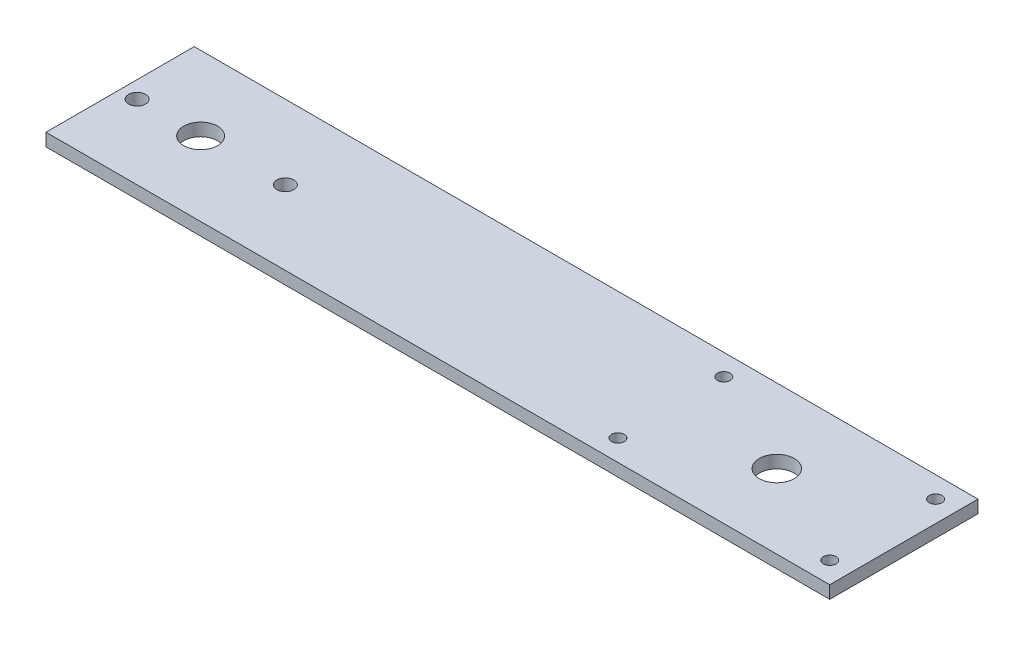
ISO-10303-21;
HEADER;
FILE_DESCRIPTION(('STEP AP214'),'2;1');
FILE_NAME('part.step','',(''),(''),'','','');
FILE_SCHEMA(('AUTOMOTIVE_DESIGN { 1 0 10303 214 1 1 1 1 }'));
ENDSEC;
DATA;
#1=APPLICATION_CONTEXT('core data for automotive mechanical design processes');
#2=APPLICATION_PROTOCOL_DEFINITION('international standard','automotive_design',2000,#1);
#3=PRODUCT_CONTEXT('',#1,'mechanical');
#4=PRODUCT('Part','Part','',(#3));
#5=PRODUCT_RELATED_PRODUCT_CATEGORY('part','',(#4));
#6=PRODUCT_DEFINITION_FORMATION('','',#4);
#7=PRODUCT_DEFINITION_CONTEXT('part definition',#1,'design');
#8=PRODUCT_DEFINITION('design','',#6,#7);
#9=PRODUCT_DEFINITION_SHAPE('','',#8);
#10=(LENGTH_UNIT() NAMED_UNIT(*) SI_UNIT(.MILLI.,.METRE.));
#11=(NAMED_UNIT(*) PLANE_ANGLE_UNIT() SI_UNIT($,.RADIAN.));
#12=(NAMED_UNIT(*) SI_UNIT($,.STERADIAN.) SOLID_ANGLE_UNIT());
#13=UNCERTAINTY_MEASURE_WITH_UNIT(LENGTH_MEASURE(1.E-05),#10,'distance_accuracy_value','');
#14=(GEOMETRIC_REPRESENTATION_CONTEXT(3) GLOBAL_UNCERTAINTY_ASSIGNED_CONTEXT((#13)) GLOBAL_UNIT_ASSIGNED_CONTEXT((#10,
#11,#12)) REPRESENTATION_CONTEXT('',''));
#15=CARTESIAN_POINT('',(0.,0.,0.));
#16=DIRECTION('',(0.,0.,1.));
#17=DIRECTION('',(1.,0.,0.));
#18=AXIS2_PLACEMENT_3D('',#15,#16,#17);
#19=CARTESIAN_POINT('',(92.5,3.,0.));
#20=DIRECTION('',(1.,0.,0.));
#21=DIRECTION('',(0.,0.,-1.));
#22=AXIS2_PLACEMENT_3D('',#19,#20,#21);
#23=PLANE('',#22);
#24=DIRECTION('',(0.,0.,1.));
#25=VECTOR('',#24,1.);
#26=CARTESIAN_POINT('',(92.5,0.,0.));
#27=LINE('',#26,#25);
#28=CARTESIAN_POINT('',(92.5,0.,-17.5));
#29=VERTEX_POINT('',#28);
#30=CARTESIAN_POINT('',(92.5,0.,17.5));
#31=VERTEX_POINT('',#30);
#32=EDGE_CURVE('E117',#29,#31,#27,.T.);
#33=ORIENTED_EDGE('',*,*,#32,.F.);
#34=DIRECTION('',(0.,-1.,0.));
#35=VECTOR('',#34,1.);
#36=CARTESIAN_POINT('',(92.5,3.,-17.5));
#37=LINE('',#36,#35);
#38=CARTESIAN_POINT('',(92.5,3.,-17.5));
#39=VERTEX_POINT('',#38);
#40=EDGE_CURVE('E11',#39,#29,#37,.T.);
#41=ORIENTED_EDGE('',*,*,#40,.F.);
#42=DIRECTION('',(0.,0.,1.));
#43=VECTOR('',#42,1.);
#44=CARTESIAN_POINT('',(92.5,3.,0.));
#45=LINE('',#44,#43);
#46=CARTESIAN_POINT('',(92.5,3.,17.5));
#47=VERTEX_POINT('',#46);
#48=EDGE_CURVE('E97',#39,#47,#45,.T.);
#49=ORIENTED_EDGE('',*,*,#48,.T.);
#50=DIRECTION('',(0.,-1.,0.));
#51=VECTOR('',#50,1.);
#52=CARTESIAN_POINT('',(92.5,3.,17.5));
#53=LINE('',#52,#51);
#54=EDGE_CURVE('E76',#47,#31,#53,.T.);
#55=ORIENTED_EDGE('',*,*,#54,.T.);
#56=EDGE_LOOP('',(#33,#41,#49,#55));
#57=FACE_BOUND('',#56,.T.);
#58=ADVANCED_FACE('F36',(#57),#23,.T.);
#59=CARTESIAN_POINT('',(0.,3.,-17.5));
#60=DIRECTION('',(0.,0.,-1.));
#61=DIRECTION('',(-1.,0.,0.));
#62=AXIS2_PLACEMENT_3D('',#59,#60,#61);
#63=PLANE('',#62);
#64=DIRECTION('',(1.,0.,0.));
#65=VECTOR('',#64,1.);
#66=CARTESIAN_POINT('',(0.,0.,-17.5));
#67=LINE('',#66,#65);
#68=CARTESIAN_POINT('',(-92.5,0.,-17.5));
#69=VERTEX_POINT('',#68);
#70=EDGE_CURVE('E88',#69,#29,#67,.T.);
#71=ORIENTED_EDGE('',*,*,#70,.F.);
#72=DIRECTION('',(0.,-1.,0.));
#73=VECTOR('',#72,1.);
#74=CARTESIAN_POINT('',(-92.5,3.,-17.5));
#75=LINE('',#74,#73);
#76=CARTESIAN_POINT('',(-92.5,3.,-17.5));
#77=VERTEX_POINT('',#76);
#78=EDGE_CURVE('E45',#77,#69,#75,.T.);
#79=ORIENTED_EDGE('',*,*,#78,.F.);
#80=DIRECTION('',(1.,0.,0.));
#81=VECTOR('',#80,1.);
#82=CARTESIAN_POINT('',(0.,3.,-17.5));
#83=LINE('',#82,#81);
#84=EDGE_CURVE('E86',#77,#39,#83,.T.);
#85=ORIENTED_EDGE('',*,*,#84,.T.);
#86=ORIENTED_EDGE('',*,*,#40,.T.);
#87=EDGE_LOOP('',(#71,#79,#85,#86));
#88=FACE_BOUND('',#87,.T.);
#89=ADVANCED_FACE('F84',(#88),#63,.T.);
#90=CARTESIAN_POINT('',(-92.5,3.,0.));
#91=DIRECTION('',(1.,0.,0.));
#92=DIRECTION('',(0.,0.,-1.));
#93=AXIS2_PLACEMENT_3D('',#90,#91,#92);
#94=PLANE('',#93);
#95=DIRECTION('',(0.,0.,1.));
#96=VECTOR('',#95,1.);
#97=CARTESIAN_POINT('',(-92.5,0.,0.));
#98=LINE('',#97,#96);
#99=CARTESIAN_POINT('',(-92.5,0.,17.5));
#100=VERTEX_POINT('',#99);
#101=EDGE_CURVE('E120',#69,#100,#98,.T.);
#102=ORIENTED_EDGE('',*,*,#101,.T.);
#103=DIRECTION('',(0.,-1.,0.));
#104=VECTOR('',#103,1.);
#105=CARTESIAN_POINT('',(-92.5,3.,17.5));
#106=LINE('',#105,#104);
#107=CARTESIAN_POINT('',(-92.5,3.,17.5));
#108=VERTEX_POINT('',#107);
#109=EDGE_CURVE('E91',#108,#100,#106,.T.);
#110=ORIENTED_EDGE('',*,*,#109,.F.);
#111=DIRECTION('',(0.,0.,1.));
#112=VECTOR('',#111,1.);
#113=CARTESIAN_POINT('',(-92.5,3.,0.));
#114=LINE('',#113,#112);
#115=EDGE_CURVE('E93',#77,#108,#114,.T.);
#116=ORIENTED_EDGE('',*,*,#115,.F.);
#117=ORIENTED_EDGE('',*,*,#78,.T.);
#118=EDGE_LOOP('',(#102,#110,#116,#117));
#119=FACE_BOUND('',#118,.T.);
#120=ADVANCED_FACE('F94',(#119),#94,.F.);
#121=CARTESIAN_POINT('',(62.5,3.,0.));
#122=DIRECTION('',(0.,-1.,0.));
#123=DIRECTION('',(0.,0.,-1.));
#124=AXIS2_PLACEMENT_3D('',#121,#122,#123);
#125=CYLINDRICAL_SURFACE('',#124,4.125);
#126=CARTESIAN_POINT('',(62.5,3.,0.));
#127=DIRECTION('',(0.,1.,0.));
#128=DIRECTION('',(0.,0.,1.));
#129=AXIS2_PLACEMENT_3D('',#126,#127,#128);
#130=CIRCLE('',#129,4.125);
#131=CARTESIAN_POINT('',(62.5,3.,4.12500000000004));
#132=VERTEX_POINT('',#131);
#133=EDGE_CURVE('E99',#132,#132,#130,.T.);
#134=ORIENTED_EDGE('',*,*,#133,.T.);
#135=EDGE_LOOP('',(#134));
#136=FACE_BOUND('',#135,.T.);
#137=CARTESIAN_POINT('',(62.5,0.,0.));
#138=DIRECTION('',(0.,1.,0.));
#139=DIRECTION('',(0.,0.,1.));
#140=AXIS2_PLACEMENT_3D('',#137,#138,#139);
#141=CIRCLE('',#140,4.125);
#142=CARTESIAN_POINT('',(62.5,0.,4.12500000000004));
#143=VERTEX_POINT('',#142);
#144=EDGE_CURVE('E114',#143,#143,#141,.T.);
#145=ORIENTED_EDGE('',*,*,#144,.F.);
#146=EDGE_LOOP('',(#145));
#147=FACE_BOUND('',#146,.T.);
#148=ADVANCED_FACE('F136',(#136,#147),#125,.F.);
#149=CARTESIAN_POINT('',(-88.4999999999916,3.,3.62442888202086E-11));
#150=DIRECTION('',(0.,-1.,0.));
#151=DIRECTION('',(0.,0.,-1.));
#152=AXIS2_PLACEMENT_3D('',#149,#150,#151);
#153=CYLINDRICAL_SURFACE('',#152,2.00000000000315);
#154=CARTESIAN_POINT('',(-88.4999999999916,3.,3.62442888202086E-11));
#155=DIRECTION('',(0.,1.,0.));
#156=DIRECTION('',(0.,0.,1.));
#157=AXIS2_PLACEMENT_3D('',#154,#155,#156);
#158=CIRCLE('',#157,2.00000000000315);
#159=CARTESIAN_POINT('',(-88.4999999999916,3.,2.0000000000394));
#160=VERTEX_POINT('',#159);
#161=EDGE_CURVE('E279',#160,#160,#158,.T.);
#162=ORIENTED_EDGE('',*,*,#161,.T.);
#163=EDGE_LOOP('',(#162));
#164=FACE_BOUND('',#163,.T.);
#165=CARTESIAN_POINT('',(-88.4999999999916,0.,3.62442888202086E-11));
#166=DIRECTION('',(0.,1.,0.));
#167=DIRECTION('',(0.,0.,1.));
#168=AXIS2_PLACEMENT_3D('',#165,#166,#167);
#169=CIRCLE('',#168,2.00000000000315);
#170=CARTESIAN_POINT('',(-88.4999999999916,0.,2.0000000000394));
#171=VERTEX_POINT('',#170);
#172=EDGE_CURVE('E111',#171,#171,#169,.T.);
#173=ORIENTED_EDGE('',*,*,#172,.F.);
#174=EDGE_LOOP('',(#173));
#175=FACE_BOUND('',#174,.T.);
#176=ADVANCED_FACE('F139',(#164,#175),#153,.F.);
#177=CARTESIAN_POINT('',(-53.4999999999916,3.,3.2832243868075E-11));
#178=DIRECTION('',(0.,-1.,0.));
#179=DIRECTION('',(0.,0.,-1.));
#180=AXIS2_PLACEMENT_3D('',#177,#178,#179);
#181=CYLINDRICAL_SURFACE('',#180,2.00000000000207);
#182=CARTESIAN_POINT('',(-53.4999999999916,3.,3.2832243868075E-11));
#183=DIRECTION('',(0.,1.,0.));
#184=DIRECTION('',(0.,0.,1.));
#185=AXIS2_PLACEMENT_3D('',#182,#183,#184);
#186=CIRCLE('',#185,2.00000000000207);
#187=CARTESIAN_POINT('',(-53.4999999999916,3.,2.0000000000349));
#188=VERTEX_POINT('',#187);
#189=EDGE_CURVE('E153',#188,#188,#186,.T.);
#190=ORIENTED_EDGE('',*,*,#189,.T.);
#191=EDGE_LOOP('',(#190));
#192=FACE_BOUND('',#191,.T.);
#193=CARTESIAN_POINT('',(-53.4999999999916,0.,3.2832243868075E-11));
#194=DIRECTION('',(0.,1.,0.));
#195=DIRECTION('',(0.,0.,1.));
#196=AXIS2_PLACEMENT_3D('',#193,#194,#195);
#197=CIRCLE('',#196,2.00000000000207);
#198=CARTESIAN_POINT('',(-53.4999999999916,0.,2.0000000000349));
#199=VERTEX_POINT('',#198);
#200=EDGE_CURVE('E107',#199,#199,#197,.T.);
#201=ORIENTED_EDGE('',*,*,#200,.F.);
#202=EDGE_LOOP('',(#201));
#203=FACE_BOUND('',#202,.T.);
#204=ADVANCED_FACE('F142',(#192,#203),#181,.F.);
#205=CARTESIAN_POINT('',(-73.4999999999917,3.,3.57240279025284E-11));
#206=DIRECTION('',(0.,-1.,0.));
#207=DIRECTION('',(0.,0.,-1.));
#208=AXIS2_PLACEMENT_3D('',#205,#206,#207);
#209=CYLINDRICAL_SURFACE('',#208,4.00000000000001);
#210=CARTESIAN_POINT('',(-73.4999999999917,3.,3.57240279025284E-11));
#211=DIRECTION('',(0.,1.,0.));
#212=DIRECTION('',(0.,0.,1.));
#213=AXIS2_PLACEMENT_3D('',#210,#211,#212);
#214=CIRCLE('',#213,4.00000000000001);
#215=CARTESIAN_POINT('',(-73.4999999999917,3.,4.00000000003573));
#216=VERTEX_POINT('',#215);
#217=EDGE_CURVE('E123',#216,#216,#214,.T.);
#218=ORIENTED_EDGE('',*,*,#217,.T.);
#219=EDGE_LOOP('',(#218));
#220=FACE_BOUND('',#219,.T.);
#221=CARTESIAN_POINT('',(-73.4999999999917,0.,3.57240279025284E-11));
#222=DIRECTION('',(0.,1.,0.));
#223=DIRECTION('',(0.,0.,1.));
#224=AXIS2_PLACEMENT_3D('',#221,#222,#223);
#225=CIRCLE('',#224,4.00000000000001);
#226=CARTESIAN_POINT('',(-73.4999999999917,0.,4.00000000003573));
#227=VERTEX_POINT('',#226);
#228=EDGE_CURVE('E104',#227,#227,#225,.T.);
#229=ORIENTED_EDGE('',*,*,#228,.F.);
#230=EDGE_LOOP('',(#229));
#231=FACE_BOUND('',#230,.T.);
#232=ADVANCED_FACE('F38',(#220,#231),#209,.F.);
#233=CARTESIAN_POINT('',(0.,3.,17.5));
#234=DIRECTION('',(0.,0.,-1.));
#235=DIRECTION('',(-1.,0.,0.));
#236=AXIS2_PLACEMENT_3D('',#233,#234,#235);
#237=PLANE('',#236);
#238=DIRECTION('',(1.,0.,0.));
#239=VECTOR('',#238,1.);
#240=CARTESIAN_POINT('',(0.,0.,17.5));
#241=LINE('',#240,#239);
#242=EDGE_CURVE('E69',#100,#31,#241,.T.);
#243=ORIENTED_EDGE('',*,*,#242,.T.);
#244=ORIENTED_EDGE('',*,*,#54,.F.);
#245=DIRECTION('',(1.,0.,0.));
#246=VECTOR('',#245,1.);
#247=CARTESIAN_POINT('',(0.,3.,17.5));
#248=LINE('',#247,#246);
#249=EDGE_CURVE('E53',#108,#47,#248,.T.);
#250=ORIENTED_EDGE('',*,*,#249,.F.);
#251=ORIENTED_EDGE('',*,*,#109,.T.);
#252=EDGE_LOOP('',(#243,#244,#250,#251));
#253=FACE_BOUND('',#252,.T.);
#254=ADVANCED_FACE('F126',(#253),#237,.F.);
#255=CARTESIAN_POINT('',(0.,3.,0.));
#256=DIRECTION('',(0.,1.,0.));
#257=DIRECTION('',(0.,0.,1.));
#258=AXIS2_PLACEMENT_3D('',#255,#256,#257);
#259=PLANE('',#258);
#260=CARTESIAN_POINT('',(37.5,3.,-12.5));
#261=DIRECTION('',(0.,1.,0.));
#262=DIRECTION('',(0.,0.,-1.));
#263=AXIS2_PLACEMENT_3D('',#260,#261,#262);
#264=CIRCLE('',#263,1.5);
#265=CARTESIAN_POINT('',(37.5,3.,-14.));
#266=VERTEX_POINT('',#265);
#267=EDGE_CURVE('E264',#266,#266,#264,.T.);
#268=ORIENTED_EDGE('',*,*,#267,.F.);
#269=EDGE_LOOP('',(#268));
#270=FACE_BOUND('',#269,.T.);
#271=CARTESIAN_POINT('',(37.5,3.,12.5));
#272=DIRECTION('',(0.,1.,0.));
#273=DIRECTION('',(0.,0.,1.));
#274=AXIS2_PLACEMENT_3D('',#271,#272,#273);
#275=CIRCLE('',#274,1.5);
#276=CARTESIAN_POINT('',(37.5,3.,14.));
#277=VERTEX_POINT('',#276);
#278=EDGE_CURVE('E266',#277,#277,#275,.T.);
#279=ORIENTED_EDGE('',*,*,#278,.F.);
#280=EDGE_LOOP('',(#279));
#281=FACE_BOUND('',#280,.T.);
#282=CARTESIAN_POINT('',(87.5,3.,12.5));
#283=DIRECTION('',(0.,1.,0.));
#284=DIRECTION('',(0.,0.,-1.));
#285=AXIS2_PLACEMENT_3D('',#282,#283,#284);
#286=CIRCLE('',#285,1.5);
#287=CARTESIAN_POINT('',(87.5,3.,11.));
#288=VERTEX_POINT('',#287);
#289=EDGE_CURVE('E295',#288,#288,#286,.T.);
#290=ORIENTED_EDGE('',*,*,#289,.F.);
#291=EDGE_LOOP('',(#290));
#292=FACE_BOUND('',#291,.T.);
#293=CARTESIAN_POINT('',(87.5,3.,-12.5));
#294=DIRECTION('',(0.,1.,0.));
#295=DIRECTION('',(0.,0.,1.));
#296=AXIS2_PLACEMENT_3D('',#293,#294,#295);
#297=CIRCLE('',#296,1.5);
#298=CARTESIAN_POINT('',(87.5,3.,-11.));
#299=VERTEX_POINT('',#298);
#300=EDGE_CURVE('E272',#299,#299,#297,.T.);
#301=ORIENTED_EDGE('',*,*,#300,.F.);
#302=EDGE_LOOP('',(#301));
#303=FACE_BOUND('',#302,.T.);
#304=ORIENTED_EDGE('',*,*,#217,.F.);
#305=EDGE_LOOP('',(#304));
#306=FACE_BOUND('',#305,.T.);
#307=ORIENTED_EDGE('',*,*,#189,.F.);
#308=EDGE_LOOP('',(#307));
#309=FACE_BOUND('',#308,.T.);
#310=ORIENTED_EDGE('',*,*,#161,.F.);
#311=EDGE_LOOP('',(#310));
#312=FACE_BOUND('',#311,.T.);
#313=ORIENTED_EDGE('',*,*,#133,.F.);
#314=EDGE_LOOP('',(#313));
#315=FACE_BOUND('',#314,.T.);
#316=ORIENTED_EDGE('',*,*,#48,.F.);
#317=ORIENTED_EDGE('',*,*,#84,.F.);
#318=ORIENTED_EDGE('',*,*,#115,.T.);
#319=ORIENTED_EDGE('',*,*,#249,.T.);
#320=EDGE_LOOP('',(#316,#317,#318,#319));
#321=FACE_BOUND('',#320,.T.);
#322=ADVANCED_FACE('F96',(#270,#281,#292,#303,#306,#309,#312,#315,#321),#259,.T.);
#323=CARTESIAN_POINT('',(0.,0.,0.));
#324=DIRECTION('',(0.,1.,0.));
#325=DIRECTION('',(0.,0.,1.));
#326=AXIS2_PLACEMENT_3D('',#323,#324,#325);
#327=PLANE('',#326);
#328=CARTESIAN_POINT('',(37.5,0.,-12.5));
#329=DIRECTION('',(0.,1.,0.));
#330=DIRECTION('',(0.,0.,-1.));
#331=AXIS2_PLACEMENT_3D('',#328,#329,#330);
#332=CIRCLE('',#331,1.5);
#333=CARTESIAN_POINT('',(37.5,0.,-14.));
#334=VERTEX_POINT('',#333);
#335=EDGE_CURVE('E261',#334,#334,#332,.T.);
#336=ORIENTED_EDGE('',*,*,#335,.T.);
#337=EDGE_LOOP('',(#336));
#338=FACE_BOUND('',#337,.T.);
#339=CARTESIAN_POINT('',(37.5,0.,12.5));
#340=DIRECTION('',(0.,1.,0.));
#341=DIRECTION('',(0.,0.,1.));
#342=AXIS2_PLACEMENT_3D('',#339,#340,#341);
#343=CIRCLE('',#342,1.5);
#344=CARTESIAN_POINT('',(37.5,0.,14.));
#345=VERTEX_POINT('',#344);
#346=EDGE_CURVE('E300',#345,#345,#343,.T.);
#347=ORIENTED_EDGE('',*,*,#346,.T.);
#348=EDGE_LOOP('',(#347));
#349=FACE_BOUND('',#348,.T.);
#350=CARTESIAN_POINT('',(87.5,0.,12.5));
#351=DIRECTION('',(0.,1.,0.));
#352=DIRECTION('',(0.,0.,-1.));
#353=AXIS2_PLACEMENT_3D('',#350,#351,#352);
#354=CIRCLE('',#353,1.5);
#355=CARTESIAN_POINT('',(87.5,0.,11.));
#356=VERTEX_POINT('',#355);
#357=EDGE_CURVE('E275',#356,#356,#354,.T.);
#358=ORIENTED_EDGE('',*,*,#357,.T.);
#359=EDGE_LOOP('',(#358));
#360=FACE_BOUND('',#359,.T.);
#361=CARTESIAN_POINT('',(87.5,0.,-12.5));
#362=DIRECTION('',(0.,1.,0.));
#363=DIRECTION('',(0.,0.,1.));
#364=AXIS2_PLACEMENT_3D('',#361,#362,#363);
#365=CIRCLE('',#364,1.5);
#366=CARTESIAN_POINT('',(87.5,0.,-11.));
#367=VERTEX_POINT('',#366);
#368=EDGE_CURVE('E108',#367,#367,#365,.T.);
#369=ORIENTED_EDGE('',*,*,#368,.T.);
#370=EDGE_LOOP('',(#369));
#371=FACE_BOUND('',#370,.T.);
#372=ORIENTED_EDGE('',*,*,#228,.T.);
#373=EDGE_LOOP('',(#372));
#374=FACE_BOUND('',#373,.T.);
#375=ORIENTED_EDGE('',*,*,#200,.T.);
#376=EDGE_LOOP('',(#375));
#377=FACE_BOUND('',#376,.T.);
#378=ORIENTED_EDGE('',*,*,#172,.T.);
#379=EDGE_LOOP('',(#378));
#380=FACE_BOUND('',#379,.T.);
#381=ORIENTED_EDGE('',*,*,#144,.T.);
#382=EDGE_LOOP('',(#381));
#383=FACE_BOUND('',#382,.T.);
#384=ORIENTED_EDGE('',*,*,#32,.T.);
#385=ORIENTED_EDGE('',*,*,#242,.F.);
#386=ORIENTED_EDGE('',*,*,#101,.F.);
#387=ORIENTED_EDGE('',*,*,#70,.T.);
#388=EDGE_LOOP('',(#384,#385,#386,#387));
#389=FACE_BOUND('',#388,.T.);
#390=ADVANCED_FACE('F127',(#338,#349,#360,#371,#374,#377,#380,#383,#389),#327,.F.);
#391=CARTESIAN_POINT('',(87.5,0.,-12.5));
#392=DIRECTION('',(0.,1.,0.));
#393=DIRECTION('',(0.,0.,1.));
#394=AXIS2_PLACEMENT_3D('',#391,#392,#393);
#395=CYLINDRICAL_SURFACE('',#394,1.5);
#396=ORIENTED_EDGE('',*,*,#368,.F.);
#397=EDGE_LOOP('',(#396));
#398=FACE_BOUND('',#397,.T.);
#399=ORIENTED_EDGE('',*,*,#300,.T.);
#400=EDGE_LOOP('',(#399));
#401=FACE_BOUND('',#400,.T.);
#402=ADVANCED_FACE('F158',(#398,#401),#395,.F.);
#403=CARTESIAN_POINT('',(87.5,0.,12.5));
#404=DIRECTION('',(0.,1.,0.));
#405=DIRECTION('',(0.,0.,1.));
#406=AXIS2_PLACEMENT_3D('',#403,#404,#405);
#407=CYLINDRICAL_SURFACE('',#406,1.5);
#408=ORIENTED_EDGE('',*,*,#357,.F.);
#409=EDGE_LOOP('',(#408));
#410=FACE_BOUND('',#409,.T.);
#411=ORIENTED_EDGE('',*,*,#289,.T.);
#412=EDGE_LOOP('',(#411));
#413=FACE_BOUND('',#412,.T.);
#414=ADVANCED_FACE('F170',(#410,#413),#407,.F.);
#415=CARTESIAN_POINT('',(37.5,0.,12.5));
#416=DIRECTION('',(0.,1.,0.));
#417=DIRECTION('',(0.,0.,1.));
#418=AXIS2_PLACEMENT_3D('',#415,#416,#417);
#419=CYLINDRICAL_SURFACE('',#418,1.5);
#420=ORIENTED_EDGE('',*,*,#346,.F.);
#421=EDGE_LOOP('',(#420));
#422=FACE_BOUND('',#421,.T.);
#423=ORIENTED_EDGE('',*,*,#278,.T.);
#424=EDGE_LOOP('',(#423));
#425=FACE_BOUND('',#424,.T.);
#426=ADVANCED_FACE('F235',(#422,#425),#419,.F.);
#427=CARTESIAN_POINT('',(37.5,0.,-12.5));
#428=DIRECTION('',(0.,1.,0.));
#429=DIRECTION('',(0.,0.,1.));
#430=AXIS2_PLACEMENT_3D('',#427,#428,#429);
#431=CYLINDRICAL_SURFACE('',#430,1.5);
#432=ORIENTED_EDGE('',*,*,#335,.F.);
#433=EDGE_LOOP('',(#432));
#434=FACE_BOUND('',#433,.T.);
#435=ORIENTED_EDGE('',*,*,#267,.T.);
#436=EDGE_LOOP('',(#435));
#437=FACE_BOUND('',#436,.T.);
#438=ADVANCED_FACE('F245',(#434,#437),#431,.F.);
#439=CLOSED_SHELL('',(#58,#89,#120,#148,#176,#204,#232,#254,#322,#390,#402,#414,#426,#438));
#440=MANIFOLD_SOLID_BREP('B2',#439);
#441=ADVANCED_BREP_SHAPE_REPRESENTATION('',(#18,#440),#14);
#442=SHAPE_DEFINITION_REPRESENTATION(#9,#441);
ENDSEC;
END-ISO-10303-21;
